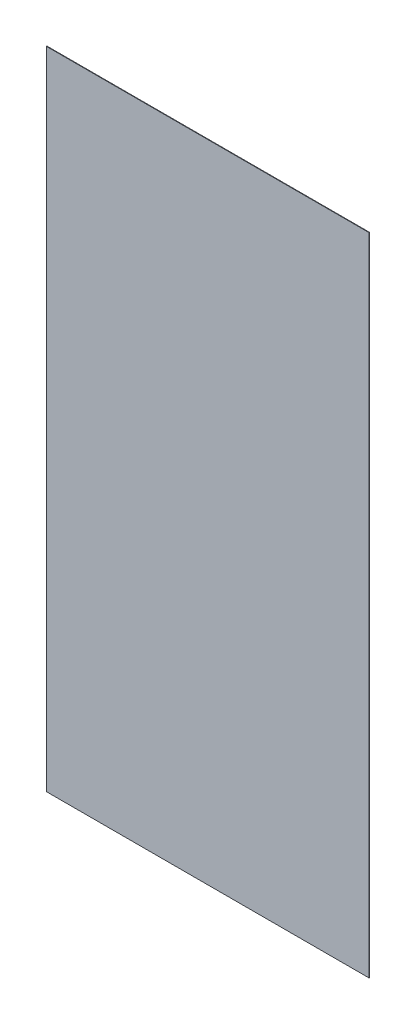
ISO-10303-21;
HEADER;
FILE_DESCRIPTION(('STEP AP214'),'2;1');
FILE_NAME('part.step','',(''),(''),'','','');
FILE_SCHEMA(('AUTOMOTIVE_DESIGN { 1 0 10303 214 1 1 1 1 }'));
ENDSEC;
DATA;
#1=APPLICATION_CONTEXT('core data for automotive mechanical design processes');
#2=APPLICATION_PROTOCOL_DEFINITION('international standard','automotive_design',2000,#1);
#3=PRODUCT_CONTEXT('',#1,'mechanical');
#4=PRODUCT('Part','Part','',(#3));
#5=PRODUCT_RELATED_PRODUCT_CATEGORY('part','',(#4));
#6=PRODUCT_DEFINITION_FORMATION('','',#4);
#7=PRODUCT_DEFINITION_CONTEXT('part definition',#1,'design');
#8=PRODUCT_DEFINITION('design','',#6,#7);
#9=PRODUCT_DEFINITION_SHAPE('','',#8);
#10=(LENGTH_UNIT() NAMED_UNIT(*) SI_UNIT(.MILLI.,.METRE.));
#11=(NAMED_UNIT(*) PLANE_ANGLE_UNIT() SI_UNIT($,.RADIAN.));
#12=(NAMED_UNIT(*) SI_UNIT($,.STERADIAN.) SOLID_ANGLE_UNIT());
#13=UNCERTAINTY_MEASURE_WITH_UNIT(LENGTH_MEASURE(1.E-05),#10,'distance_accuracy_value','');
#14=(GEOMETRIC_REPRESENTATION_CONTEXT(3) GLOBAL_UNCERTAINTY_ASSIGNED_CONTEXT((#13)) GLOBAL_UNIT_ASSIGNED_CONTEXT((#10,
#11,#12)) REPRESENTATION_CONTEXT('',''));
#15=CARTESIAN_POINT('',(0.,0.,0.));
#16=DIRECTION('',(0.,0.,1.));
#17=DIRECTION('',(1.,0.,0.));
#18=AXIS2_PLACEMENT_3D('',#15,#16,#17);
#19=CARTESIAN_POINT('',(625.,1250.,2.));
#20=DIRECTION('',(-1.,0.,0.));
#21=DIRECTION('',(0.,-1.,0.));
#22=AXIS2_PLACEMENT_3D('',#19,#20,#21);
#23=PLANE('',#22);
#24=DIRECTION('',(0.,1.,0.));
#25=VECTOR('',#24,1.);
#26=CARTESIAN_POINT('',(625.,1250.,0.));
#27=LINE('',#26,#25);
#28=CARTESIAN_POINT('',(625.,-1250.,0.));
#29=VERTEX_POINT('',#28);
#30=CARTESIAN_POINT('',(625.,1250.,0.));
#31=VERTEX_POINT('',#30);
#32=EDGE_CURVE('E98',#29,#31,#27,.T.);
#33=ORIENTED_EDGE('',*,*,#32,.T.);
#34=DIRECTION('',(0.,0.,-1.));
#35=VECTOR('',#34,1.);
#36=CARTESIAN_POINT('',(625.,1250.,2.));
#37=LINE('',#36,#35);
#38=CARTESIAN_POINT('',(625.,1250.,2.));
#39=VERTEX_POINT('',#38);
#40=EDGE_CURVE('E11',#39,#31,#37,.T.);
#41=ORIENTED_EDGE('',*,*,#40,.F.);
#42=DIRECTION('',(0.,1.,0.));
#43=VECTOR('',#42,1.);
#44=CARTESIAN_POINT('',(625.,1250.,2.));
#45=LINE('',#44,#43);
#46=CARTESIAN_POINT('',(625.,-1250.,2.));
#47=VERTEX_POINT('',#46);
#48=EDGE_CURVE('E86',#47,#39,#45,.T.);
#49=ORIENTED_EDGE('',*,*,#48,.F.);
#50=DIRECTION('',(0.,0.,-1.));
#51=VECTOR('',#50,1.);
#52=CARTESIAN_POINT('',(625.,-1250.,2.));
#53=LINE('',#52,#51);
#54=EDGE_CURVE('E94',#47,#29,#53,.T.);
#55=ORIENTED_EDGE('',*,*,#54,.T.);
#56=EDGE_LOOP('',(#33,#41,#49,#55));
#57=FACE_BOUND('',#56,.T.);
#58=ADVANCED_FACE('F35',(#57),#23,.F.);
#59=CARTESIAN_POINT('',(-625.,1250.,2.));
#60=DIRECTION('',(0.,-1.,0.));
#61=DIRECTION('',(0.,0.,-1.));
#62=AXIS2_PLACEMENT_3D('',#59,#60,#61);
#63=PLANE('',#62);
#64=DIRECTION('',(-1.,0.,0.));
#65=VECTOR('',#64,1.);
#66=CARTESIAN_POINT('',(-625.,1250.,0.));
#67=LINE('',#66,#65);
#68=CARTESIAN_POINT('',(-625.,1250.,0.));
#69=VERTEX_POINT('',#68);
#70=EDGE_CURVE('E90',#31,#69,#67,.T.);
#71=ORIENTED_EDGE('',*,*,#70,.T.);
#72=DIRECTION('',(0.,0.,-1.));
#73=VECTOR('',#72,1.);
#74=CARTESIAN_POINT('',(-625.,1250.,2.));
#75=LINE('',#74,#73);
#76=CARTESIAN_POINT('',(-625.,1250.,2.));
#77=VERTEX_POINT('',#76);
#78=EDGE_CURVE('E43',#77,#69,#75,.T.);
#79=ORIENTED_EDGE('',*,*,#78,.F.);
#80=DIRECTION('',(-1.,0.,0.));
#81=VECTOR('',#80,1.);
#82=CARTESIAN_POINT('',(-625.,1250.,2.));
#83=LINE('',#82,#81);
#84=EDGE_CURVE('E81',#39,#77,#83,.T.);
#85=ORIENTED_EDGE('',*,*,#84,.F.);
#86=ORIENTED_EDGE('',*,*,#40,.T.);
#87=EDGE_LOOP('',(#71,#79,#85,#86));
#88=FACE_BOUND('',#87,.T.);
#89=ADVANCED_FACE('F89',(#88),#63,.F.);
#90=CARTESIAN_POINT('',(-625.,1250.,2.));
#91=DIRECTION('',(1.,0.,0.));
#92=DIRECTION('',(0.,1.,0.));
#93=AXIS2_PLACEMENT_3D('',#90,#91,#92);
#94=PLANE('',#93);
#95=DIRECTION('',(0.,-1.,0.));
#96=VECTOR('',#95,1.);
#97=CARTESIAN_POINT('',(-625.,1250.,0.));
#98=LINE('',#97,#96);
#99=CARTESIAN_POINT('',(-625.,-1250.,0.));
#100=VERTEX_POINT('',#99);
#101=EDGE_CURVE('E68',#69,#100,#98,.T.);
#102=ORIENTED_EDGE('',*,*,#101,.T.);
#103=DIRECTION('',(0.,0.,-1.));
#104=VECTOR('',#103,1.);
#105=CARTESIAN_POINT('',(-625.,-1250.,2.));
#106=LINE('',#105,#104);
#107=CARTESIAN_POINT('',(-625.,-1250.,2.));
#108=VERTEX_POINT('',#107);
#109=EDGE_CURVE('E91',#108,#100,#106,.T.);
#110=ORIENTED_EDGE('',*,*,#109,.F.);
#111=DIRECTION('',(0.,-1.,0.));
#112=VECTOR('',#111,1.);
#113=CARTESIAN_POINT('',(-625.,1250.,2.));
#114=LINE('',#113,#112);
#115=EDGE_CURVE('E84',#77,#108,#114,.T.);
#116=ORIENTED_EDGE('',*,*,#115,.F.);
#117=ORIENTED_EDGE('',*,*,#78,.T.);
#118=EDGE_LOOP('',(#102,#110,#116,#117));
#119=FACE_BOUND('',#118,.T.);
#120=ADVANCED_FACE('F92',(#119),#94,.F.);
#121=CARTESIAN_POINT('',(-625.,-1250.,2.));
#122=DIRECTION('',(0.,1.,0.));
#123=DIRECTION('',(0.,0.,1.));
#124=AXIS2_PLACEMENT_3D('',#121,#122,#123);
#125=PLANE('',#124);
#126=DIRECTION('',(1.,0.,0.));
#127=VECTOR('',#126,1.);
#128=CARTESIAN_POINT('',(-625.,-1250.,0.));
#129=LINE('',#128,#127);
#130=EDGE_CURVE('E74',#100,#29,#129,.T.);
#131=ORIENTED_EDGE('',*,*,#130,.T.);
#132=ORIENTED_EDGE('',*,*,#54,.F.);
#133=DIRECTION('',(1.,0.,0.));
#134=VECTOR('',#133,1.);
#135=CARTESIAN_POINT('',(-625.,-1250.,2.));
#136=LINE('',#135,#134);
#137=EDGE_CURVE('E51',#108,#47,#136,.T.);
#138=ORIENTED_EDGE('',*,*,#137,.F.);
#139=ORIENTED_EDGE('',*,*,#109,.T.);
#140=EDGE_LOOP('',(#131,#132,#138,#139));
#141=FACE_BOUND('',#140,.T.);
#142=ADVANCED_FACE('F105',(#141),#125,.F.);
#143=CARTESIAN_POINT('',(0.,0.,2.));
#144=DIRECTION('',(0.,0.,1.));
#145=DIRECTION('',(1.,0.,0.));
#146=AXIS2_PLACEMENT_3D('',#143,#144,#145);
#147=PLANE('',#146);
#148=ORIENTED_EDGE('',*,*,#48,.T.);
#149=ORIENTED_EDGE('',*,*,#84,.T.);
#150=ORIENTED_EDGE('',*,*,#115,.T.);
#151=ORIENTED_EDGE('',*,*,#137,.T.);
#152=EDGE_LOOP('',(#148,#149,#150,#151));
#153=FACE_BOUND('',#152,.T.);
#154=ADVANCED_FACE('F82',(#153),#147,.T.);
#155=CARTESIAN_POINT('',(0.,0.,0.));
#156=DIRECTION('',(0.,0.,1.));
#157=DIRECTION('',(1.,0.,0.));
#158=AXIS2_PLACEMENT_3D('',#155,#156,#157);
#159=PLANE('',#158);
#160=ORIENTED_EDGE('',*,*,#32,.F.);
#161=ORIENTED_EDGE('',*,*,#130,.F.);
#162=ORIENTED_EDGE('',*,*,#101,.F.);
#163=ORIENTED_EDGE('',*,*,#70,.F.);
#164=EDGE_LOOP('',(#160,#161,#162,#163));
#165=FACE_BOUND('',#164,.T.);
#166=ADVANCED_FACE('F108',(#165),#159,.F.);
#167=CLOSED_SHELL('',(#58,#89,#120,#142,#154,#166));
#168=MANIFOLD_SOLID_BREP('B2',#167);
#169=ADVANCED_BREP_SHAPE_REPRESENTATION('',(#18,#168),#14);
#170=SHAPE_DEFINITION_REPRESENTATION(#9,#169);
ENDSEC;
END-ISO-10303-21;
